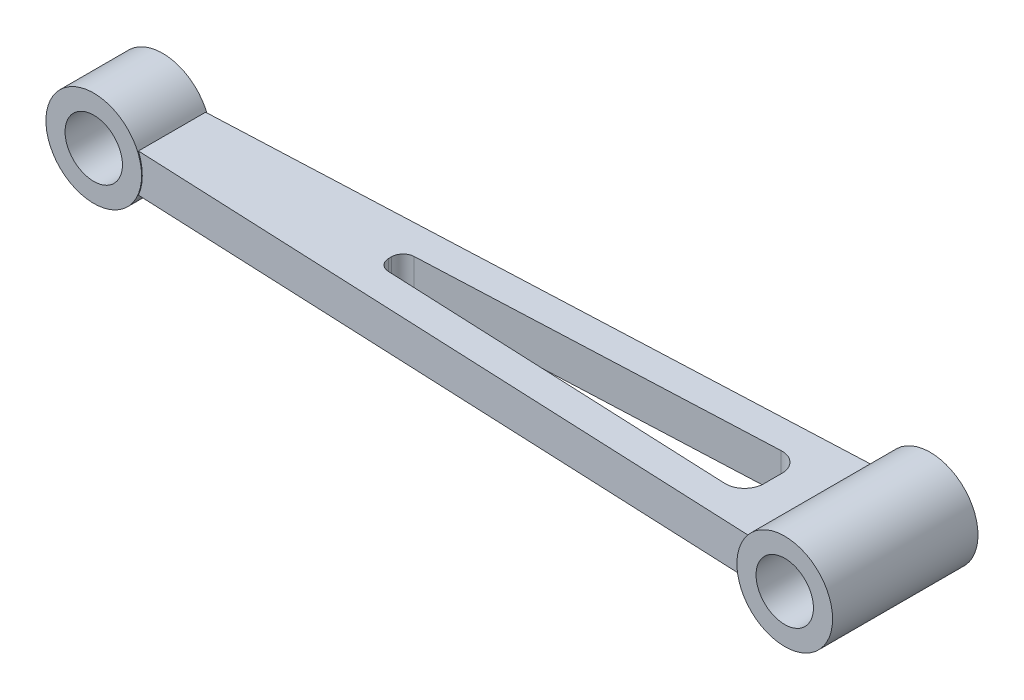
ISO-10303-21;
HEADER;
FILE_DESCRIPTION(('STEP AP214'),'2;1');
FILE_NAME('part.step','',(''),(''),'','','');
FILE_SCHEMA(('AUTOMOTIVE_DESIGN { 1 0 10303 214 1 1 1 1 }'));
ENDSEC;
DATA;
#1=APPLICATION_CONTEXT('core data for automotive mechanical design processes');
#2=APPLICATION_PROTOCOL_DEFINITION('international standard','automotive_design',2000,#1);
#3=PRODUCT_CONTEXT('',#1,'mechanical');
#4=PRODUCT('Part','Part','',(#3));
#5=PRODUCT_RELATED_PRODUCT_CATEGORY('part','',(#4));
#6=PRODUCT_DEFINITION_FORMATION('','',#4);
#7=PRODUCT_DEFINITION_CONTEXT('part definition',#1,'design');
#8=PRODUCT_DEFINITION('design','',#6,#7);
#9=PRODUCT_DEFINITION_SHAPE('','',#8);
#10=(LENGTH_UNIT() NAMED_UNIT(*) SI_UNIT(.MILLI.,.METRE.));
#11=(NAMED_UNIT(*) PLANE_ANGLE_UNIT() SI_UNIT($,.RADIAN.));
#12=(NAMED_UNIT(*) SI_UNIT($,.STERADIAN.) SOLID_ANGLE_UNIT());
#13=UNCERTAINTY_MEASURE_WITH_UNIT(LENGTH_MEASURE(1.E-05),#10,'distance_accuracy_value','');
#14=(GEOMETRIC_REPRESENTATION_CONTEXT(3) GLOBAL_UNCERTAINTY_ASSIGNED_CONTEXT((#13)) GLOBAL_UNIT_ASSIGNED_CONTEXT((#10,
#11,#12)) REPRESENTATION_CONTEXT('',''));
#15=CARTESIAN_POINT('',(0.,0.,0.));
#16=DIRECTION('',(0.,0.,1.));
#17=DIRECTION('',(1.,0.,0.));
#18=AXIS2_PLACEMENT_3D('',#15,#16,#17);
#19=CARTESIAN_POINT('',(-0.192807984991824,10.,-4.41602888411888));
#20=DIRECTION('',(-0.0436193873653291,0.,-0.999048221581858));
#21=DIRECTION('',(-0.999048221581858,0.,0.0436193873653291));
#22=AXIS2_PLACEMENT_3D('',#19,#20,#21);
#23=PLANE('',#22);
#24=DIRECTION('',(0.999048221581858,0.,-0.0436193873653291));
#25=VECTOR('',#24,1.);
#26=CARTESIAN_POINT('',(-0.192807984991824,0.,-4.41602888411888));
#27=LINE('',#26,#25);
#28=CARTESIAN_POINT('',(-23.9463523223953,0.,-3.37892674092886));
#29=VERTEX_POINT('',#28);
#30=CARTESIAN_POINT('',(67.966408902874,0.,-7.39192456134841));
#31=VERTEX_POINT('',#30);
#32=EDGE_CURVE('E224',#29,#31,#27,.T.);
#33=ORIENTED_EDGE('',*,*,#32,.T.);
#34=DIRECTION('',(0.,-1.,0.));
#35=VECTOR('',#34,1.);
#36=CARTESIAN_POINT('',(67.966408902874,10.,-7.39192456134841));
#37=LINE('',#36,#35);
#38=CARTESIAN_POINT('',(67.966408902874,10.,-7.39192456134841));
#39=VERTEX_POINT('',#38);
#40=EDGE_CURVE('E273',#39,#31,#37,.T.);
#41=ORIENTED_EDGE('',*,*,#40,.F.);
#42=DIRECTION('',(0.999048221581858,0.,-0.0436193873653291));
#43=VECTOR('',#42,1.);
#44=CARTESIAN_POINT('',(-0.192807984991824,10.,-4.41602888411888));
#45=LINE('',#44,#43);
#46=CARTESIAN_POINT('',(-23.9463523223953,10.,-3.37892674092886));
#47=VERTEX_POINT('',#46);
#48=EDGE_CURVE('E225',#47,#39,#45,.T.);
#49=ORIENTED_EDGE('',*,*,#48,.F.);
#50=DIRECTION('',(0.,-1.,0.));
#51=VECTOR('',#50,1.);
#52=CARTESIAN_POINT('',(-23.9463523223953,10.,-3.37892674092886));
#53=LINE('',#52,#51);
#54=EDGE_CURVE('E245',#47,#29,#53,.T.);
#55=ORIENTED_EDGE('',*,*,#54,.T.);
#56=EDGE_LOOP('',(#33,#41,#49,#55));
#57=FACE_BOUND('',#56,.T.);
#58=ADVANCED_FACE('F43',(#57),#23,.F.);
#59=CARTESIAN_POINT('',(68.1845058397006,10.,-2.39668345343912));
#60=DIRECTION('',(0.,-1.,0.));
#61=DIRECTION('',(0.,0.,-1.));
#62=AXIS2_PLACEMENT_3D('',#59,#60,#61);
#63=CYLINDRICAL_SURFACE('',#62,5.);
#64=CARTESIAN_POINT('',(68.1845058397006,0.,-2.39668345343912));
#65=DIRECTION('',(0.,1.,0.));
#66=DIRECTION('',(0.,0.,1.));
#67=AXIS2_PLACEMENT_3D('',#64,#65,#66);
#68=CIRCLE('',#67,5.);
#69=CARTESIAN_POINT('',(73.1845058397006,0.,-2.39668345343908));
#70=VERTEX_POINT('',#69);
#71=EDGE_CURVE('E249',#31,#70,#68,.F.);
#72=ORIENTED_EDGE('',*,*,#71,.T.);
#73=DIRECTION('',(0.,-1.,0.));
#74=VECTOR('',#73,1.);
#75=CARTESIAN_POINT('',(73.1845058397006,10.,-2.39668345343908));
#76=LINE('',#75,#74);
#77=CARTESIAN_POINT('',(73.1845058397006,10.,-2.39668345343908));
#78=VERTEX_POINT('',#77);
#79=EDGE_CURVE('E269',#78,#70,#76,.T.);
#80=ORIENTED_EDGE('',*,*,#79,.F.);
#81=CARTESIAN_POINT('',(68.1845058397006,10.,-2.39668345343912));
#82=DIRECTION('',(0.,1.,0.));
#83=DIRECTION('',(0.,0.,1.));
#84=AXIS2_PLACEMENT_3D('',#81,#82,#83);
#85=CIRCLE('',#84,5.);
#86=EDGE_CURVE('E229',#39,#78,#85,.F.);
#87=ORIENTED_EDGE('',*,*,#86,.F.);
#88=ORIENTED_EDGE('',*,*,#40,.T.);
#89=EDGE_LOOP('',(#72,#80,#87,#88));
#90=FACE_BOUND('',#89,.T.);
#91=ADVANCED_FACE('F308',(#90),#63,.F.);
#92=CARTESIAN_POINT('',(73.1845058397006,10.,0.));
#93=DIRECTION('',(1.,0.,0.));
#94=DIRECTION('',(0.,0.,-1.));
#95=AXIS2_PLACEMENT_3D('',#92,#93,#94);
#96=PLANE('',#95);
#97=DIRECTION('',(0.,0.,1.));
#98=VECTOR('',#97,1.);
#99=CARTESIAN_POINT('',(73.1845058397006,0.,0.));
#100=LINE('',#99,#98);
#101=CARTESIAN_POINT('',(73.1845058397006,0.,2.39668345343908));
#102=VERTEX_POINT('',#101);
#103=EDGE_CURVE('E252',#70,#102,#100,.T.);
#104=ORIENTED_EDGE('',*,*,#103,.T.);
#105=DIRECTION('',(0.,-1.,0.));
#106=VECTOR('',#105,1.);
#107=CARTESIAN_POINT('',(73.1845058397006,10.,2.39668345343908));
#108=LINE('',#107,#106);
#109=CARTESIAN_POINT('',(73.1845058397006,10.,2.39668345343908));
#110=VERTEX_POINT('',#109);
#111=EDGE_CURVE('E213',#110,#102,#108,.T.);
#112=ORIENTED_EDGE('',*,*,#111,.F.);
#113=DIRECTION('',(0.,0.,1.));
#114=VECTOR('',#113,1.);
#115=CARTESIAN_POINT('',(73.1845058397006,10.,0.));
#116=LINE('',#115,#114);
#117=EDGE_CURVE('E233',#78,#110,#116,.T.);
#118=ORIENTED_EDGE('',*,*,#117,.F.);
#119=ORIENTED_EDGE('',*,*,#79,.T.);
#120=EDGE_LOOP('',(#104,#112,#118,#119));
#121=FACE_BOUND('',#120,.T.);
#122=ADVANCED_FACE('F313',(#121),#96,.F.);
#123=CARTESIAN_POINT('',(-0.541763083914455,10.,-12.4084146567737));
#124=DIRECTION('',(0.043619387365329,0.,0.999048221581858));
#125=DIRECTION('',(0.999048221581858,0.,-0.043619387365329));
#126=AXIS2_PLACEMENT_3D('',#123,#124,#125);
#127=PLANE('',#126);
#128=DIRECTION('',(-0.999048221581858,0.,0.043619387365329));
#129=VECTOR('',#128,1.);
#130=CARTESIAN_POINT('',(-0.541763083914455,10.,-12.4084146567737));
#131=LINE('',#130,#129);
#132=CARTESIAN_POINT('',(83.8235607626104,10.,-16.0918842446944));
#133=VERTEX_POINT('',#132);
#134=CARTESIAN_POINT('',(-83.8235607626104,10.,-8.77225284300653));
#135=VERTEX_POINT('',#134);
#136=EDGE_CURVE('E236',#133,#135,#131,.T.);
#137=ORIENTED_EDGE('',*,*,#136,.F.);
#138=CARTESIAN_POINT('',(95.28,5.,-16.5920831841728));
#139=DIRECTION('',(0.043619387365329,0.,0.999048221581858));
#140=DIRECTION('',(-0.999048221581858,0.,0.043619387365329));
#141=AXIS2_PLACEMENT_3D('',#138,#139,#140);
#142=ELLIPSE('',#141,12.5119085645415,12.5);
#143=CARTESIAN_POINT('',(83.8235607626104,0.,-16.0918842446944));
#144=VERTEX_POINT('',#143);
#145=EDGE_CURVE('E65',#133,#144,#142,.T.);
#146=ORIENTED_EDGE('',*,*,#145,.T.);
#147=DIRECTION('',(-0.999048221581858,0.,0.043619387365329));
#148=VECTOR('',#147,1.);
#149=CARTESIAN_POINT('',(-0.541763083914455,0.,-12.4084146567737));
#150=LINE('',#149,#148);
#151=CARTESIAN_POINT('',(-83.8235607626104,0.,-8.77225284300653));
#152=VERTEX_POINT('',#151);
#153=EDGE_CURVE('E146',#144,#152,#150,.T.);
#154=ORIENTED_EDGE('',*,*,#153,.T.);
#155=CARTESIAN_POINT('',(-95.28,5.,-8.27205390352811));
#156=DIRECTION('',(0.043619387365329,0.,0.999048221581858));
#157=DIRECTION('',(-0.999048221581858,0.,0.043619387365329));
#158=AXIS2_PLACEMENT_3D('',#155,#156,#157);
#159=ELLIPSE('',#158,12.5119085645415,12.5);
#160=EDGE_CURVE('E181',#152,#135,#159,.T.);
#161=ORIENTED_EDGE('',*,*,#160,.T.);
#162=EDGE_LOOP('',(#137,#146,#154,#161));
#163=FACE_BOUND('',#162,.T.);
#164=ADVANCED_FACE('F281',(#163),#127,.F.);
#165=CARTESIAN_POINT('',(-26.8154941602994,10.,0.));
#166=DIRECTION('',(-1.,0.,0.));
#167=DIRECTION('',(0.,0.,1.));
#168=AXIS2_PLACEMENT_3D('',#165,#166,#167);
#169=PLANE('',#168);
#170=DIRECTION('',(0.,0.,-1.));
#171=VECTOR('',#170,1.);
#172=CARTESIAN_POINT('',(-26.8154941602994,0.,0.));
#173=LINE('',#172,#171);
#174=CARTESIAN_POINT('',(-26.8154941602994,0.,0.381782076183264));
#175=VERTEX_POINT('',#174);
#176=CARTESIAN_POINT('',(-26.8154941602994,0.,-0.381782076183264));
#177=VERTEX_POINT('',#176);
#178=EDGE_CURVE('E257',#175,#177,#173,.T.);
#179=ORIENTED_EDGE('',*,*,#178,.T.);
#180=DIRECTION('',(0.,-1.,0.));
#181=VECTOR('',#180,1.);
#182=CARTESIAN_POINT('',(-26.8154941602994,10.,-0.381782076183264));
#183=LINE('',#182,#181);
#184=CARTESIAN_POINT('',(-26.8154941602994,10.,-0.381782076183264));
#185=VERTEX_POINT('',#184);
#186=EDGE_CURVE('E265',#185,#177,#183,.T.);
#187=ORIENTED_EDGE('',*,*,#186,.F.);
#188=DIRECTION('',(0.,0.,-1.));
#189=VECTOR('',#188,1.);
#190=CARTESIAN_POINT('',(-26.8154941602994,10.,0.));
#191=LINE('',#190,#189);
#192=CARTESIAN_POINT('',(-26.8154941602994,10.,0.381782076183264));
#193=VERTEX_POINT('',#192);
#194=EDGE_CURVE('E239',#193,#185,#191,.T.);
#195=ORIENTED_EDGE('',*,*,#194,.F.);
#196=DIRECTION('',(0.,-1.,0.));
#197=VECTOR('',#196,1.);
#198=CARTESIAN_POINT('',(-26.8154941602994,10.,0.381782076183264));
#199=LINE('',#198,#197);
#200=EDGE_CURVE('E217',#193,#175,#199,.T.);
#201=ORIENTED_EDGE('',*,*,#200,.T.);
#202=EDGE_LOOP('',(#179,#187,#195,#201));
#203=FACE_BOUND('',#202,.T.);
#204=ADVANCED_FACE('F297',(#203),#169,.F.);
#205=CARTESIAN_POINT('',(-23.8154941602994,10.,-0.381782076183284));
#206=DIRECTION('',(0.,-1.,0.));
#207=DIRECTION('',(0.,0.,-1.));
#208=AXIS2_PLACEMENT_3D('',#205,#206,#207);
#209=CYLINDRICAL_SURFACE('',#208,3.);
#210=CARTESIAN_POINT('',(-23.8154941602994,0.,-0.381782076183284));
#211=DIRECTION('',(0.,1.,0.));
#212=DIRECTION('',(0.,0.,1.));
#213=AXIS2_PLACEMENT_3D('',#210,#211,#212);
#214=CIRCLE('',#213,3.);
#215=EDGE_CURVE('E230',#177,#29,#214,.F.);
#216=ORIENTED_EDGE('',*,*,#215,.T.);
#217=ORIENTED_EDGE('',*,*,#54,.F.);
#218=CARTESIAN_POINT('',(-23.8154941602994,10.,-0.381782076183284));
#219=DIRECTION('',(0.,1.,0.));
#220=DIRECTION('',(0.,0.,1.));
#221=AXIS2_PLACEMENT_3D('',#218,#219,#220);
#222=CIRCLE('',#221,3.);
#223=EDGE_CURVE('E242',#185,#47,#222,.F.);
#224=ORIENTED_EDGE('',*,*,#223,.F.);
#225=ORIENTED_EDGE('',*,*,#186,.T.);
#226=EDGE_LOOP('',(#216,#217,#224,#225));
#227=FACE_BOUND('',#226,.T.);
#228=ADVANCED_FACE('F285',(#227),#209,.F.);
#229=CARTESIAN_POINT('',(0.,10.,0.));
#230=DIRECTION('',(0.,1.,0.));
#231=DIRECTION('',(0.,0.,1.));
#232=AXIS2_PLACEMENT_3D('',#229,#230,#231);
#233=PLANE('',#232);
#234=DIRECTION('',(0.,0.,1.));
#235=VECTOR('',#234,1.);
#236=CARTESIAN_POINT('',(83.8235607626104,10.,-19.));
#237=LINE('',#236,#235);
#238=CARTESIAN_POINT('',(83.8235607626103,10.,16.0918842446944));
#239=VERTEX_POINT('',#238);
#240=EDGE_CURVE('E58',#133,#239,#237,.T.);
#241=ORIENTED_EDGE('',*,*,#240,.F.);
#242=ORIENTED_EDGE('',*,*,#136,.T.);
#243=DIRECTION('',(0.,0.,1.));
#244=VECTOR('',#243,1.);
#245=CARTESIAN_POINT('',(-83.8235607626104,10.,-9.));
#246=LINE('',#245,#244);
#247=CARTESIAN_POINT('',(-83.8235607626103,10.,8.77225284300653));
#248=VERTEX_POINT('',#247);
#249=EDGE_CURVE('E177',#248,#135,#246,.F.);
#250=ORIENTED_EDGE('',*,*,#249,.F.);
#251=DIRECTION('',(-0.999048221581858,0.,-0.043619387365329));
#252=VECTOR('',#251,1.);
#253=CARTESIAN_POINT('',(-0.541763083914455,10.,12.4084146567737));
#254=LINE('',#253,#252);
#255=EDGE_CURVE('E194',#239,#248,#254,.T.);
#256=ORIENTED_EDGE('',*,*,#255,.F.);
#257=EDGE_LOOP('',(#241,#242,#250,#256));
#258=FACE_BOUND('',#257,.T.);
#259=CARTESIAN_POINT('',(-23.8154941602994,10.,0.381782076183284));
#260=DIRECTION('',(0.,-1.,0.));
#261=DIRECTION('',(0.,0.,-1.));
#262=AXIS2_PLACEMENT_3D('',#259,#260,#261);
#263=CIRCLE('',#262,3.);
#264=CARTESIAN_POINT('',(-23.9463523223953,10.,3.37892674092886));
#265=VERTEX_POINT('',#264);
#266=EDGE_CURVE('E190',#193,#265,#263,.F.);
#267=ORIENTED_EDGE('',*,*,#266,.F.);
#268=ORIENTED_EDGE('',*,*,#194,.T.);
#269=ORIENTED_EDGE('',*,*,#223,.T.);
#270=ORIENTED_EDGE('',*,*,#48,.T.);
#271=ORIENTED_EDGE('',*,*,#86,.T.);
#272=ORIENTED_EDGE('',*,*,#117,.T.);
#273=CARTESIAN_POINT('',(68.1845058397006,10.,2.39668345343912));
#274=DIRECTION('',(0.,-1.,0.));
#275=DIRECTION('',(0.,0.,-1.));
#276=AXIS2_PLACEMENT_3D('',#273,#274,#275);
#277=CIRCLE('',#276,5.);
#278=CARTESIAN_POINT('',(67.966408902874,10.,7.39192456134841));
#279=VERTEX_POINT('',#278);
#280=EDGE_CURVE('E197',#279,#110,#277,.F.);
#281=ORIENTED_EDGE('',*,*,#280,.F.);
#282=DIRECTION('',(0.999048221581858,0.,0.0436193873653291));
#283=VECTOR('',#282,1.);
#284=CARTESIAN_POINT('',(-0.192807984991824,10.,4.41602888411888));
#285=LINE('',#284,#283);
#286=EDGE_CURVE('E186',#265,#279,#285,.T.);
#287=ORIENTED_EDGE('',*,*,#286,.F.);
#288=EDGE_LOOP('',(#267,#268,#269,#270,#271,#272,#281,#287));
#289=FACE_BOUND('',#288,.T.);
#290=ADVANCED_FACE('F282',(#258,#289),#233,.T.);
#291=CARTESIAN_POINT('',(0.,0.,0.));
#292=DIRECTION('',(0.,1.,0.));
#293=DIRECTION('',(0.,0.,1.));
#294=AXIS2_PLACEMENT_3D('',#291,#292,#293);
#295=PLANE('',#294);
#296=ORIENTED_EDGE('',*,*,#178,.F.);
#297=CARTESIAN_POINT('',(-23.8154941602994,0.,0.381782076183284));
#298=DIRECTION('',(0.,-1.,0.));
#299=DIRECTION('',(0.,0.,-1.));
#300=AXIS2_PLACEMENT_3D('',#297,#298,#299);
#301=CIRCLE('',#300,3.);
#302=CARTESIAN_POINT('',(-23.9463523223953,0.,3.37892674092886));
#303=VERTEX_POINT('',#302);
#304=EDGE_CURVE('E141',#175,#303,#301,.F.);
#305=ORIENTED_EDGE('',*,*,#304,.T.);
#306=DIRECTION('',(0.999048221581858,0.,0.0436193873653291));
#307=VECTOR('',#306,1.);
#308=CARTESIAN_POINT('',(-0.192807984991824,0.,4.41602888411888));
#309=LINE('',#308,#307);
#310=CARTESIAN_POINT('',(67.966408902874,0.,7.39192456134841));
#311=VERTEX_POINT('',#310);
#312=EDGE_CURVE('E185',#303,#311,#309,.T.);
#313=ORIENTED_EDGE('',*,*,#312,.T.);
#314=CARTESIAN_POINT('',(68.1845058397006,0.,2.39668345343912));
#315=DIRECTION('',(0.,-1.,0.));
#316=DIRECTION('',(0.,0.,-1.));
#317=AXIS2_PLACEMENT_3D('',#314,#315,#316);
#318=CIRCLE('',#317,5.);
#319=EDGE_CURVE('E140',#311,#102,#318,.F.);
#320=ORIENTED_EDGE('',*,*,#319,.T.);
#321=ORIENTED_EDGE('',*,*,#103,.F.);
#322=ORIENTED_EDGE('',*,*,#71,.F.);
#323=ORIENTED_EDGE('',*,*,#32,.F.);
#324=ORIENTED_EDGE('',*,*,#215,.F.);
#325=EDGE_LOOP('',(#296,#305,#313,#320,#321,#322,#323,#324));
#326=FACE_BOUND('',#325,.T.);
#327=ORIENTED_EDGE('',*,*,#153,.F.);
#328=DIRECTION('',(0.,0.,1.));
#329=VECTOR('',#328,1.);
#330=CARTESIAN_POINT('',(83.8235607626104,0.,-19.));
#331=LINE('',#330,#329);
#332=CARTESIAN_POINT('',(83.8235607626103,0.,16.0918842446944));
#333=VERTEX_POINT('',#332);
#334=EDGE_CURVE('E144',#144,#333,#331,.T.);
#335=ORIENTED_EDGE('',*,*,#334,.T.);
#336=DIRECTION('',(-0.999048221581858,0.,-0.043619387365329));
#337=VECTOR('',#336,1.);
#338=CARTESIAN_POINT('',(-0.541763083914455,0.,12.4084146567737));
#339=LINE('',#338,#337);
#340=CARTESIAN_POINT('',(-83.8235607626104,0.,8.77225284300653));
#341=VERTEX_POINT('',#340);
#342=EDGE_CURVE('E132',#333,#341,#339,.T.);
#343=ORIENTED_EDGE('',*,*,#342,.T.);
#344=DIRECTION('',(0.,0.,1.));
#345=VECTOR('',#344,1.);
#346=CARTESIAN_POINT('',(-83.8235607626104,0.,-9.));
#347=LINE('',#346,#345);
#348=EDGE_CURVE('E174',#341,#152,#347,.F.);
#349=ORIENTED_EDGE('',*,*,#348,.T.);
#350=EDGE_LOOP('',(#327,#335,#343,#349));
#351=FACE_BOUND('',#350,.T.);
#352=ADVANCED_FACE('F145',(#326,#351),#295,.F.);
#353=CARTESIAN_POINT('',(-0.192807984991824,10.,4.41602888411888));
#354=DIRECTION('',(0.0436193873653291,0.,-0.999048221581858));
#355=DIRECTION('',(-0.999048221581858,0.,-0.0436193873653291));
#356=AXIS2_PLACEMENT_3D('',#353,#354,#355);
#357=PLANE('',#356);
#358=ORIENTED_EDGE('',*,*,#312,.F.);
#359=DIRECTION('',(0.,-1.,0.));
#360=VECTOR('',#359,1.);
#361=CARTESIAN_POINT('',(-23.9463523223953,10.,3.37892674092886));
#362=LINE('',#361,#360);
#363=EDGE_CURVE('E221',#265,#303,#362,.T.);
#364=ORIENTED_EDGE('',*,*,#363,.F.);
#365=ORIENTED_EDGE('',*,*,#286,.T.);
#366=DIRECTION('',(0.,-1.,0.));
#367=VECTOR('',#366,1.);
#368=CARTESIAN_POINT('',(67.966408902874,10.,7.39192456134841));
#369=LINE('',#368,#367);
#370=EDGE_CURVE('E201',#279,#311,#369,.T.);
#371=ORIENTED_EDGE('',*,*,#370,.T.);
#372=EDGE_LOOP('',(#358,#364,#365,#371));
#373=FACE_BOUND('',#372,.T.);
#374=ADVANCED_FACE('F318',(#373),#357,.T.);
#375=CARTESIAN_POINT('',(-23.8154941602994,10.,0.381782076183284));
#376=DIRECTION('',(0.,-1.,0.));
#377=DIRECTION('',(0.,0.,-1.));
#378=AXIS2_PLACEMENT_3D('',#375,#376,#377);
#379=CYLINDRICAL_SURFACE('',#378,3.);
#380=ORIENTED_EDGE('',*,*,#304,.F.);
#381=ORIENTED_EDGE('',*,*,#200,.F.);
#382=ORIENTED_EDGE('',*,*,#266,.T.);
#383=ORIENTED_EDGE('',*,*,#363,.T.);
#384=EDGE_LOOP('',(#380,#381,#382,#383));
#385=FACE_BOUND('',#384,.T.);
#386=ADVANCED_FACE('F294',(#385),#379,.F.);
#387=CARTESIAN_POINT('',(-0.541763083914455,10.,12.4084146567737));
#388=DIRECTION('',(-0.043619387365329,0.,0.999048221581858));
#389=DIRECTION('',(0.999048221581858,0.,0.043619387365329));
#390=AXIS2_PLACEMENT_3D('',#387,#388,#389);
#391=PLANE('',#390);
#392=CARTESIAN_POINT('',(95.28,5.,16.5920831841728));
#393=DIRECTION('',(-0.043619387365329,0.,0.999048221581858));
#394=DIRECTION('',(0.999048221581858,0.,0.043619387365329));
#395=AXIS2_PLACEMENT_3D('',#392,#393,#394);
#396=ELLIPSE('',#395,12.5119085645415,12.5);
#397=EDGE_CURVE('E11',#239,#333,#396,.T.);
#398=ORIENTED_EDGE('',*,*,#397,.F.);
#399=ORIENTED_EDGE('',*,*,#255,.T.);
#400=CARTESIAN_POINT('',(-95.28,5.,8.27205390352811));
#401=DIRECTION('',(-0.043619387365329,0.,0.999048221581858));
#402=DIRECTION('',(0.999048221581858,0.,0.043619387365329));
#403=AXIS2_PLACEMENT_3D('',#400,#401,#402);
#404=ELLIPSE('',#403,12.5119085645415,12.5);
#405=EDGE_CURVE('E51',#341,#248,#404,.T.);
#406=ORIENTED_EDGE('',*,*,#405,.F.);
#407=ORIENTED_EDGE('',*,*,#342,.F.);
#408=EDGE_LOOP('',(#398,#399,#406,#407));
#409=FACE_BOUND('',#408,.T.);
#410=ADVANCED_FACE('F134',(#409),#391,.T.);
#411=CARTESIAN_POINT('',(68.1845058397006,10.,2.39668345343912));
#412=DIRECTION('',(0.,-1.,0.));
#413=DIRECTION('',(0.,0.,-1.));
#414=AXIS2_PLACEMENT_3D('',#411,#412,#413);
#415=CYLINDRICAL_SURFACE('',#414,5.);
#416=ORIENTED_EDGE('',*,*,#319,.F.);
#417=ORIENTED_EDGE('',*,*,#370,.F.);
#418=ORIENTED_EDGE('',*,*,#280,.T.);
#419=ORIENTED_EDGE('',*,*,#111,.T.);
#420=EDGE_LOOP('',(#416,#417,#418,#419));
#421=FACE_BOUND('',#420,.T.);
#422=ADVANCED_FACE('F316',(#421),#415,.F.);
#423=CARTESIAN_POINT('',(-95.28,5.,-9.));
#424=DIRECTION('',(0.,0.,1.));
#425=DIRECTION('',(1.,0.,0.));
#426=AXIS2_PLACEMENT_3D('',#423,#424,#425);
#427=CYLINDRICAL_SURFACE('',#426,12.5);
#428=CARTESIAN_POINT('',(-95.28,5.,9.));
#429=DIRECTION('',(0.,0.,1.));
#430=DIRECTION('',(1.,0.,0.));
#431=AXIS2_PLACEMENT_3D('',#428,#429,#430);
#432=CIRCLE('',#431,12.5);
#433=CARTESIAN_POINT('',(-82.78,5.,9.));
#434=VERTEX_POINT('',#433);
#435=EDGE_CURVE('E166',#434,#434,#432,.T.);
#436=ORIENTED_EDGE('',*,*,#435,.F.);
#437=EDGE_LOOP('',(#436));
#438=FACE_BOUND('',#437,.T.);
#439=CARTESIAN_POINT('',(-95.28,5.,-9.));
#440=DIRECTION('',(0.,0.,1.));
#441=DIRECTION('',(1.,0.,0.));
#442=AXIS2_PLACEMENT_3D('',#439,#440,#441);
#443=CIRCLE('',#442,12.5);
#444=CARTESIAN_POINT('',(-82.78,5.,-9.));
#445=VERTEX_POINT('',#444);
#446=EDGE_CURVE('E170',#445,#445,#443,.T.);
#447=ORIENTED_EDGE('',*,*,#446,.T.);
#448=EDGE_LOOP('',(#447));
#449=FACE_BOUND('',#448,.T.);
#450=ORIENTED_EDGE('',*,*,#160,.F.);
#451=ORIENTED_EDGE('',*,*,#348,.F.);
#452=ORIENTED_EDGE('',*,*,#405,.T.);
#453=ORIENTED_EDGE('',*,*,#249,.T.);
#454=EDGE_LOOP('',(#450,#451,#452,#453));
#455=FACE_BOUND('',#454,.T.);
#456=ADVANCED_FACE('F279',(#438,#449,#455),#427,.T.);
#457=CARTESIAN_POINT('',(-95.28,5.,-9.));
#458=DIRECTION('',(0.,0.,1.));
#459=DIRECTION('',(1.,0.,0.));
#460=AXIS2_PLACEMENT_3D('',#457,#458,#459);
#461=PLANE('',#460);
#462=CARTESIAN_POINT('',(-95.28,5.,-9.));
#463=DIRECTION('',(0.,0.,1.));
#464=DIRECTION('',(1.,0.,0.));
#465=AXIS2_PLACEMENT_3D('',#462,#463,#464);
#466=CIRCLE('',#465,7.5);
#467=CARTESIAN_POINT('',(-87.78,5.,-9.));
#468=VERTEX_POINT('',#467);
#469=EDGE_CURVE('E162',#468,#468,#466,.T.);
#470=ORIENTED_EDGE('',*,*,#469,.T.);
#471=EDGE_LOOP('',(#470));
#472=FACE_BOUND('',#471,.T.);
#473=ORIENTED_EDGE('',*,*,#446,.F.);
#474=EDGE_LOOP('',(#473));
#475=FACE_BOUND('',#474,.T.);
#476=ADVANCED_FACE('F440',(#472,#475),#461,.F.);
#477=CARTESIAN_POINT('',(-95.28,5.,9.));
#478=DIRECTION('',(0.,0.,1.));
#479=DIRECTION('',(1.,0.,0.));
#480=AXIS2_PLACEMENT_3D('',#477,#478,#479);
#481=PLANE('',#480);
#482=CARTESIAN_POINT('',(-95.28,5.,9.));
#483=DIRECTION('',(0.,0.,1.));
#484=DIRECTION('',(1.,0.,0.));
#485=AXIS2_PLACEMENT_3D('',#482,#483,#484);
#486=CIRCLE('',#485,7.5);
#487=CARTESIAN_POINT('',(-87.78,5.,9.));
#488=VERTEX_POINT('',#487);
#489=EDGE_CURVE('E155',#488,#488,#486,.T.);
#490=ORIENTED_EDGE('',*,*,#489,.F.);
#491=EDGE_LOOP('',(#490));
#492=FACE_BOUND('',#491,.T.);
#493=ORIENTED_EDGE('',*,*,#435,.T.);
#494=EDGE_LOOP('',(#493));
#495=FACE_BOUND('',#494,.T.);
#496=ADVANCED_FACE('F431',(#492,#495),#481,.T.);
#497=CARTESIAN_POINT('',(-95.28,5.,-16.1336432836335));
#498=DIRECTION('',(0.,0.,1.));
#499=DIRECTION('',(1.,0.,0.));
#500=AXIS2_PLACEMENT_3D('',#497,#498,#499);
#501=CYLINDRICAL_SURFACE('',#500,7.5);
#502=ORIENTED_EDGE('',*,*,#489,.T.);
#503=EDGE_LOOP('',(#502));
#504=FACE_BOUND('',#503,.T.);
#505=ORIENTED_EDGE('',*,*,#469,.F.);
#506=EDGE_LOOP('',(#505));
#507=FACE_BOUND('',#506,.T.);
#508=ADVANCED_FACE('F384',(#504,#507),#501,.F.);
#509=CARTESIAN_POINT('',(95.28,5.,-19.));
#510=DIRECTION('',(0.,0.,1.));
#511=DIRECTION('',(1.,0.,0.));
#512=AXIS2_PLACEMENT_3D('',#509,#510,#511);
#513=CYLINDRICAL_SURFACE('',#512,12.5);
#514=CARTESIAN_POINT('',(95.28,5.,19.));
#515=DIRECTION('',(0.,0.,1.));
#516=DIRECTION('',(1.,0.,0.));
#517=AXIS2_PLACEMENT_3D('',#514,#515,#516);
#518=CIRCLE('',#517,12.5);
#519=CARTESIAN_POINT('',(107.78,5.,19.));
#520=VERTEX_POINT('',#519);
#521=EDGE_CURVE('E560',#520,#520,#518,.T.);
#522=ORIENTED_EDGE('',*,*,#521,.F.);
#523=EDGE_LOOP('',(#522));
#524=FACE_BOUND('',#523,.T.);
#525=CARTESIAN_POINT('',(95.28,5.,-19.));
#526=DIRECTION('',(0.,0.,1.));
#527=DIRECTION('',(1.,0.,0.));
#528=AXIS2_PLACEMENT_3D('',#525,#526,#527);
#529=CIRCLE('',#528,12.5);
#530=CARTESIAN_POINT('',(107.78,5.,-19.));
#531=VERTEX_POINT('',#530);
#532=EDGE_CURVE('E149',#531,#531,#529,.T.);
#533=ORIENTED_EDGE('',*,*,#532,.T.);
#534=EDGE_LOOP('',(#533));
#535=FACE_BOUND('',#534,.T.);
#536=ORIENTED_EDGE('',*,*,#145,.F.);
#537=ORIENTED_EDGE('',*,*,#240,.T.);
#538=ORIENTED_EDGE('',*,*,#397,.T.);
#539=ORIENTED_EDGE('',*,*,#334,.F.);
#540=EDGE_LOOP('',(#536,#537,#538,#539));
#541=FACE_BOUND('',#540,.T.);
#542=ADVANCED_FACE('F151',(#524,#535,#541),#513,.T.);
#543=CARTESIAN_POINT('',(95.28,5.,-19.));
#544=DIRECTION('',(0.,0.,1.));
#545=DIRECTION('',(1.,0.,0.));
#546=AXIS2_PLACEMENT_3D('',#543,#544,#545);
#547=PLANE('',#546);
#548=CARTESIAN_POINT('',(95.28,5.,-19.));
#549=DIRECTION('',(0.,0.,1.));
#550=DIRECTION('',(1.,0.,0.));
#551=AXIS2_PLACEMENT_3D('',#548,#549,#550);
#552=CIRCLE('',#551,7.5);
#553=CARTESIAN_POINT('',(102.78,5.,-19.));
#554=VERTEX_POINT('',#553);
#555=EDGE_CURVE('E553',#554,#554,#552,.T.);
#556=ORIENTED_EDGE('',*,*,#555,.T.);
#557=EDGE_LOOP('',(#556));
#558=FACE_BOUND('',#557,.T.);
#559=ORIENTED_EDGE('',*,*,#532,.F.);
#560=EDGE_LOOP('',(#559));
#561=FACE_BOUND('',#560,.T.);
#562=ADVANCED_FACE('F383',(#558,#561),#547,.F.);
#563=CARTESIAN_POINT('',(95.28,5.,19.));
#564=DIRECTION('',(0.,0.,1.));
#565=DIRECTION('',(1.,0.,0.));
#566=AXIS2_PLACEMENT_3D('',#563,#564,#565);
#567=PLANE('',#566);
#568=CARTESIAN_POINT('',(95.28,5.,19.));
#569=DIRECTION('',(0.,0.,1.));
#570=DIRECTION('',(1.,0.,0.));
#571=AXIS2_PLACEMENT_3D('',#568,#569,#570);
#572=CIRCLE('',#571,7.5);
#573=CARTESIAN_POINT('',(102.78,5.,19.));
#574=VERTEX_POINT('',#573);
#575=EDGE_CURVE('E556',#574,#574,#572,.T.);
#576=ORIENTED_EDGE('',*,*,#575,.F.);
#577=EDGE_LOOP('',(#576));
#578=FACE_BOUND('',#577,.T.);
#579=ORIENTED_EDGE('',*,*,#521,.T.);
#580=EDGE_LOOP('',(#579));
#581=FACE_BOUND('',#580,.T.);
#582=ADVANCED_FACE('F397',(#578,#581),#567,.T.);
#583=CARTESIAN_POINT('',(95.28,5.,-19.));
#584=DIRECTION('',(0.,0.,1.));
#585=DIRECTION('',(1.,0.,0.));
#586=AXIS2_PLACEMENT_3D('',#583,#584,#585);
#587=CYLINDRICAL_SURFACE('',#586,7.5);
#588=ORIENTED_EDGE('',*,*,#555,.F.);
#589=EDGE_LOOP('',(#588));
#590=FACE_BOUND('',#589,.T.);
#591=ORIENTED_EDGE('',*,*,#575,.T.);
#592=EDGE_LOOP('',(#591));
#593=FACE_BOUND('',#592,.T.);
#594=ADVANCED_FACE('F408',(#590,#593),#587,.F.);
#595=CLOSED_SHELL('',(#58,#91,#122,#164,#204,#228,#290,#352,#374,#386,#410,#422,#456,#476,#496,
#508,#542,#562,#582,#594));
#596=MANIFOLD_SOLID_BREP('B2',#595);
#597=ADVANCED_BREP_SHAPE_REPRESENTATION('',(#18,#596),#14);
#598=SHAPE_DEFINITION_REPRESENTATION(#9,#597);
ENDSEC;
END-ISO-10303-21;
